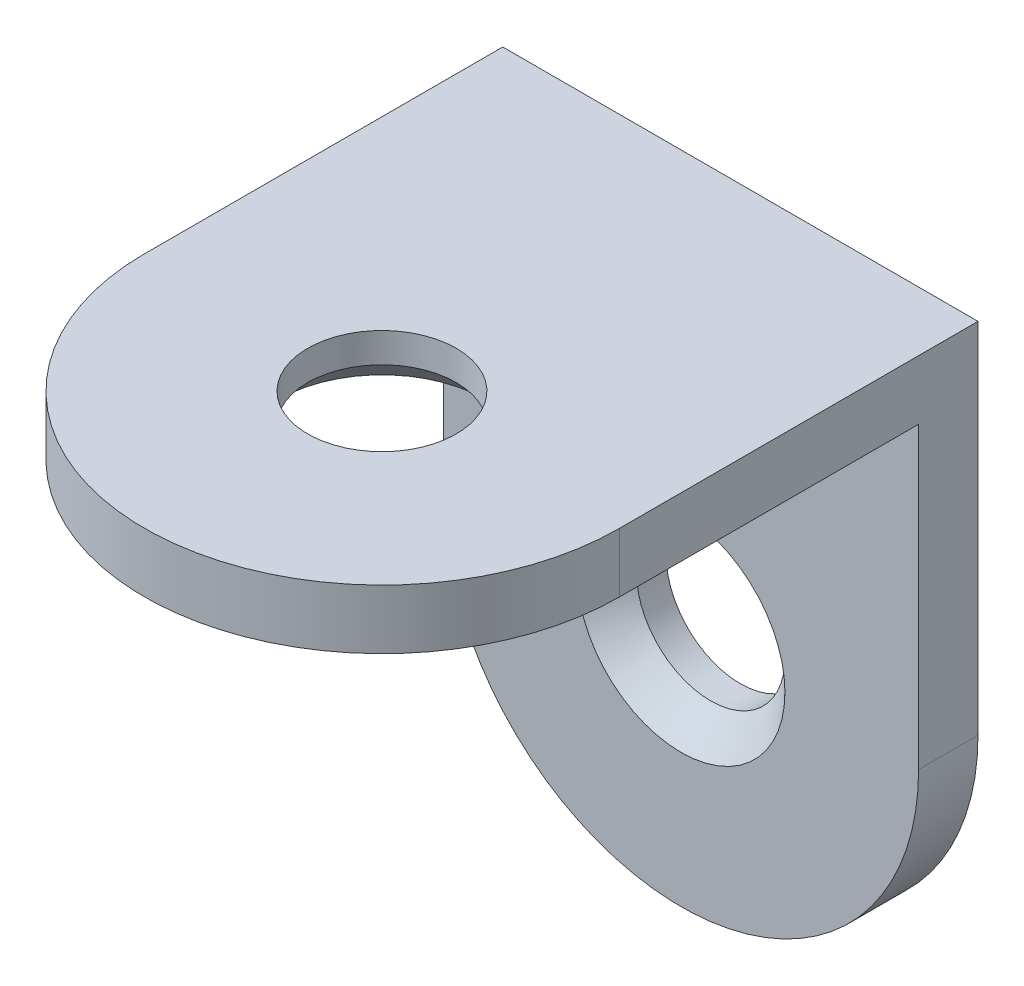
ISO-10303-21;
HEADER;
FILE_DESCRIPTION(('STEP AP214'),'2;1');
FILE_NAME('part.step','',(''),(''),'','','');
FILE_SCHEMA(('AUTOMOTIVE_DESIGN { 1 0 10303 214 1 1 1 1 }'));
ENDSEC;
DATA;
#1=APPLICATION_CONTEXT('core data for automotive mechanical design processes');
#2=APPLICATION_PROTOCOL_DEFINITION('international standard','automotive_design',2000,#1);
#3=PRODUCT_CONTEXT('',#1,'mechanical');
#4=PRODUCT('Part','Part','',(#3));
#5=PRODUCT_RELATED_PRODUCT_CATEGORY('part','',(#4));
#6=PRODUCT_DEFINITION_FORMATION('','',#4);
#7=PRODUCT_DEFINITION_CONTEXT('part definition',#1,'design');
#8=PRODUCT_DEFINITION('design','',#6,#7);
#9=PRODUCT_DEFINITION_SHAPE('','',#8);
#10=(LENGTH_UNIT() NAMED_UNIT(*) SI_UNIT(.MILLI.,.METRE.));
#11=(NAMED_UNIT(*) PLANE_ANGLE_UNIT() SI_UNIT($,.RADIAN.));
#12=(NAMED_UNIT(*) SI_UNIT($,.STERADIAN.) SOLID_ANGLE_UNIT());
#13=UNCERTAINTY_MEASURE_WITH_UNIT(LENGTH_MEASURE(1.E-05),#10,'distance_accuracy_value','');
#14=(GEOMETRIC_REPRESENTATION_CONTEXT(3) GLOBAL_UNCERTAINTY_ASSIGNED_CONTEXT((#13)) GLOBAL_UNIT_ASSIGNED_CONTEXT((#10,
#11,#12)) REPRESENTATION_CONTEXT('',''));
#15=CARTESIAN_POINT('',(0.,0.,0.));
#16=DIRECTION('',(0.,0.,1.));
#17=DIRECTION('',(1.,0.,0.));
#18=AXIS2_PLACEMENT_3D('',#15,#16,#17);
#19=CARTESIAN_POINT('',(-8.001,-20.07,2.));
#20=DIRECTION('',(0.,0.,-1.));
#21=DIRECTION('',(-1.,0.,0.));
#22=AXIS2_PLACEMENT_3D('',#19,#20,#21);
#23=PLANE('',#22);
#24=CARTESIAN_POINT('',(0.,-12.069,2.));
#25=DIRECTION('',(0.,0.,-1.));
#26=DIRECTION('',(-1.,0.,0.));
#27=AXIS2_PLACEMENT_3D('',#24,#25,#26);
#28=CIRCLE('',#27,3.50000000000001);
#29=CARTESIAN_POINT('',(-3.50000000000001,-12.069,2.));
#30=VERTEX_POINT('',#29);
#31=EDGE_CURVE('E137',#30,#30,#28,.T.);
#32=ORIENTED_EDGE('',*,*,#31,.T.);
#33=EDGE_LOOP('',(#32));
#34=FACE_BOUND('',#33,.T.);
#35=DIRECTION('',(0.,1.,0.));
#36=VECTOR('',#35,1.);
#37=CARTESIAN_POINT('',(-8.001,-20.07,2.));
#38=LINE('',#37,#36);
#39=CARTESIAN_POINT('',(-8.001,-12.069,2.));
#40=VERTEX_POINT('',#39);
#41=CARTESIAN_POINT('',(-8.001,-2.,2.));
#42=VERTEX_POINT('',#41);
#43=EDGE_CURVE('E103',#40,#42,#38,.T.);
#44=ORIENTED_EDGE('',*,*,#43,.F.);
#45=CARTESIAN_POINT('',(0.,-12.069,2.));
#46=DIRECTION('',(0.,0.,-1.));
#47=DIRECTION('',(1.,0.,0.));
#48=AXIS2_PLACEMENT_3D('',#45,#46,#47);
#49=CIRCLE('',#48,8.001);
#50=CARTESIAN_POINT('',(8.001,-12.069,2.));
#51=VERTEX_POINT('',#50);
#52=EDGE_CURVE('E89',#51,#40,#49,.T.);
#53=ORIENTED_EDGE('',*,*,#52,.F.);
#54=DIRECTION('',(0.,1.,0.));
#55=VECTOR('',#54,1.);
#56=CARTESIAN_POINT('',(8.001,-20.07,2.));
#57=LINE('',#56,#55);
#58=CARTESIAN_POINT('',(8.001,-2.,2.));
#59=VERTEX_POINT('',#58);
#60=EDGE_CURVE('E273',#51,#59,#57,.T.);
#61=ORIENTED_EDGE('',*,*,#60,.T.);
#62=DIRECTION('',(1.,0.,0.));
#63=VECTOR('',#62,1.);
#64=CARTESIAN_POINT('',(-8.001,-2.,2.));
#65=LINE('',#64,#63);
#66=EDGE_CURVE('E109',#42,#59,#65,.T.);
#67=ORIENTED_EDGE('',*,*,#66,.F.);
#68=EDGE_LOOP('',(#44,#53,#61,#67));
#69=FACE_BOUND('',#68,.T.);
#70=ADVANCED_FACE('F37',(#34,#69),#23,.F.);
#71=CARTESIAN_POINT('',(-8.001,0.,0.));
#72=DIRECTION('',(0.,0.,1.));
#73=DIRECTION('',(0.,-1.,0.));
#74=AXIS2_PLACEMENT_3D('',#71,#72,#73);
#75=PLANE('',#74);
#76=CARTESIAN_POINT('',(0.,-12.069,0.));
#77=DIRECTION('',(0.,0.,1.));
#78=DIRECTION('',(0.,-1.,0.));
#79=AXIS2_PLACEMENT_3D('',#76,#77,#78);
#80=CIRCLE('',#79,2.5);
#81=CARTESIAN_POINT('',(0.,-14.569,0.));
#82=VERTEX_POINT('',#81);
#83=EDGE_CURVE('E97',#82,#82,#80,.T.);
#84=ORIENTED_EDGE('',*,*,#83,.T.);
#85=EDGE_LOOP('',(#84));
#86=FACE_BOUND('',#85,.T.);
#87=DIRECTION('',(0.,-1.,0.));
#88=VECTOR('',#87,1.);
#89=CARTESIAN_POINT('',(8.001,0.,0.));
#90=LINE('',#89,#88);
#91=CARTESIAN_POINT('',(8.001,0.,0.));
#92=VERTEX_POINT('',#91);
#93=CARTESIAN_POINT('',(8.001,-12.069,0.));
#94=VERTEX_POINT('',#93);
#95=EDGE_CURVE('E112',#92,#94,#90,.T.);
#96=ORIENTED_EDGE('',*,*,#95,.T.);
#97=CARTESIAN_POINT('',(0.,-12.069,0.));
#98=DIRECTION('',(0.,0.,1.));
#99=DIRECTION('',(0.,-1.,0.));
#100=AXIS2_PLACEMENT_3D('',#97,#98,#99);
#101=CIRCLE('',#100,8.001);
#102=CARTESIAN_POINT('',(-8.001,-12.069,0.));
#103=VERTEX_POINT('',#102);
#104=EDGE_CURVE('E53',#94,#103,#101,.F.);
#105=ORIENTED_EDGE('',*,*,#104,.T.);
#106=DIRECTION('',(0.,-1.,0.));
#107=VECTOR('',#106,1.);
#108=CARTESIAN_POINT('',(-8.001,0.,0.));
#109=LINE('',#108,#107);
#110=CARTESIAN_POINT('',(-8.001,0.,0.));
#111=VERTEX_POINT('',#110);
#112=EDGE_CURVE('E106',#111,#103,#109,.T.);
#113=ORIENTED_EDGE('',*,*,#112,.F.);
#114=DIRECTION('',(1.,0.,0.));
#115=VECTOR('',#114,1.);
#116=CARTESIAN_POINT('',(-8.001,0.,0.));
#117=LINE('',#116,#115);
#118=EDGE_CURVE('E123',#111,#92,#117,.T.);
#119=ORIENTED_EDGE('',*,*,#118,.T.);
#120=EDGE_LOOP('',(#96,#105,#113,#119));
#121=FACE_BOUND('',#120,.T.);
#122=ADVANCED_FACE('F164',(#86,#121),#75,.F.);
#123=CARTESIAN_POINT('',(-8.001,-2.,2.));
#124=DIRECTION('',(0.,1.,0.));
#125=DIRECTION('',(0.,0.,1.));
#126=AXIS2_PLACEMENT_3D('',#123,#124,#125);
#127=PLANE('',#126);
#128=CARTESIAN_POINT('',(0.,-2.,12.069));
#129=DIRECTION('',(0.,1.,0.));
#130=DIRECTION('',(0.,0.,1.));
#131=AXIS2_PLACEMENT_3D('',#128,#129,#130);
#132=CIRCLE('',#131,3.5);
#133=CARTESIAN_POINT('',(0.,-2.,15.569));
#134=VERTEX_POINT('',#133);
#135=EDGE_CURVE('E12',#134,#134,#132,.T.);
#136=ORIENTED_EDGE('',*,*,#135,.T.);
#137=EDGE_LOOP('',(#136));
#138=FACE_BOUND('',#137,.T.);
#139=CARTESIAN_POINT('',(0.,-2.,12.069));
#140=DIRECTION('',(0.,1.,0.));
#141=DIRECTION('',(0.,0.,-1.));
#142=AXIS2_PLACEMENT_3D('',#139,#140,#141);
#143=CIRCLE('',#142,8.001);
#144=CARTESIAN_POINT('',(-8.001,-2.,12.069));
#145=VERTEX_POINT('',#144);
#146=CARTESIAN_POINT('',(8.001,-2.,12.069));
#147=VERTEX_POINT('',#146);
#148=EDGE_CURVE('E61',#145,#147,#143,.T.);
#149=ORIENTED_EDGE('',*,*,#148,.F.);
#150=DIRECTION('',(0.,0.,1.));
#151=VECTOR('',#150,1.);
#152=CARTESIAN_POINT('',(-8.001,-2.,2.));
#153=LINE('',#152,#151);
#154=EDGE_CURVE('E111',#42,#145,#153,.T.);
#155=ORIENTED_EDGE('',*,*,#154,.F.);
#156=ORIENTED_EDGE('',*,*,#66,.T.);
#157=DIRECTION('',(0.,0.,1.));
#158=VECTOR('',#157,1.);
#159=CARTESIAN_POINT('',(8.001,-2.,2.));
#160=LINE('',#159,#158);
#161=EDGE_CURVE('E275',#59,#147,#160,.T.);
#162=ORIENTED_EDGE('',*,*,#161,.T.);
#163=EDGE_LOOP('',(#149,#155,#156,#162));
#164=FACE_BOUND('',#163,.T.);
#165=ADVANCED_FACE('F170',(#138,#164),#127,.F.);
#166=CARTESIAN_POINT('',(-8.001,0.,20.07));
#167=DIRECTION('',(0.,-1.,0.));
#168=DIRECTION('',(0.,0.,-1.));
#169=AXIS2_PLACEMENT_3D('',#166,#167,#168);
#170=PLANE('',#169);
#171=CARTESIAN_POINT('',(0.,0.,12.069));
#172=DIRECTION('',(0.,-1.,0.));
#173=DIRECTION('',(0.,0.,-1.));
#174=AXIS2_PLACEMENT_3D('',#171,#172,#173);
#175=CIRCLE('',#174,2.5);
#176=CARTESIAN_POINT('',(0.,0.,9.569));
#177=VERTEX_POINT('',#176);
#178=EDGE_CURVE('E133',#177,#177,#175,.T.);
#179=ORIENTED_EDGE('',*,*,#178,.T.);
#180=EDGE_LOOP('',(#179));
#181=FACE_BOUND('',#180,.T.);
#182=DIRECTION('',(0.,0.,-1.));
#183=VECTOR('',#182,1.);
#184=CARTESIAN_POINT('',(-8.001,0.,20.07));
#185=LINE('',#184,#183);
#186=CARTESIAN_POINT('',(-8.001,0.,12.069));
#187=VERTEX_POINT('',#186);
#188=EDGE_CURVE('E114',#187,#111,#185,.T.);
#189=ORIENTED_EDGE('',*,*,#188,.F.);
#190=CARTESIAN_POINT('',(0.,0.,12.069));
#191=DIRECTION('',(0.,-1.,0.));
#192=DIRECTION('',(0.,0.,-1.));
#193=AXIS2_PLACEMENT_3D('',#190,#191,#192);
#194=CIRCLE('',#193,8.001);
#195=CARTESIAN_POINT('',(8.001,0.,12.069));
#196=VERTEX_POINT('',#195);
#197=EDGE_CURVE('E276',#187,#196,#194,.F.);
#198=ORIENTED_EDGE('',*,*,#197,.T.);
#199=DIRECTION('',(0.,0.,-1.));
#200=VECTOR('',#199,1.);
#201=CARTESIAN_POINT('',(8.001,0.,20.07));
#202=LINE('',#201,#200);
#203=EDGE_CURVE('E117',#196,#92,#202,.T.);
#204=ORIENTED_EDGE('',*,*,#203,.T.);
#205=ORIENTED_EDGE('',*,*,#118,.F.);
#206=EDGE_LOOP('',(#189,#198,#204,#205));
#207=FACE_BOUND('',#206,.T.);
#208=ADVANCED_FACE('F176',(#181,#207),#170,.F.);
#209=CARTESIAN_POINT('',(-8.001,0.,0.));
#210=DIRECTION('',(-1.,0.,0.));
#211=DIRECTION('',(0.,0.,1.));
#212=AXIS2_PLACEMENT_3D('',#209,#210,#211);
#213=PLANE('',#212);
#214=DIRECTION('',(0.,0.,1.));
#215=VECTOR('',#214,1.);
#216=CARTESIAN_POINT('',(-8.001,-12.069,-6.001));
#217=LINE('',#216,#215);
#218=EDGE_CURVE('E92',#103,#40,#217,.T.);
#219=ORIENTED_EDGE('',*,*,#218,.T.);
#220=ORIENTED_EDGE('',*,*,#43,.T.);
#221=ORIENTED_EDGE('',*,*,#154,.T.);
#222=DIRECTION('',(0.,-1.,0.));
#223=VECTOR('',#222,1.);
#224=CARTESIAN_POINT('',(-8.001,6.001,12.069));
#225=LINE('',#224,#223);
#226=EDGE_CURVE('E280',#187,#145,#225,.T.);
#227=ORIENTED_EDGE('',*,*,#226,.F.);
#228=ORIENTED_EDGE('',*,*,#188,.T.);
#229=ORIENTED_EDGE('',*,*,#112,.T.);
#230=EDGE_LOOP('',(#219,#220,#221,#227,#228,#229));
#231=FACE_BOUND('',#230,.T.);
#232=ADVANCED_FACE('F101',(#231),#213,.T.);
#233=CARTESIAN_POINT('',(8.001,0.,0.));
#234=DIRECTION('',(-1.,0.,0.));
#235=DIRECTION('',(0.,0.,1.));
#236=AXIS2_PLACEMENT_3D('',#233,#234,#235);
#237=PLANE('',#236);
#238=ORIENTED_EDGE('',*,*,#60,.F.);
#239=DIRECTION('',(0.,0.,-1.));
#240=VECTOR('',#239,1.);
#241=CARTESIAN_POINT('',(8.001,-12.069,0.));
#242=LINE('',#241,#240);
#243=EDGE_CURVE('E93',#51,#94,#242,.T.);
#244=ORIENTED_EDGE('',*,*,#243,.T.);
#245=ORIENTED_EDGE('',*,*,#95,.F.);
#246=ORIENTED_EDGE('',*,*,#203,.F.);
#247=DIRECTION('',(0.,-1.,0.));
#248=VECTOR('',#247,1.);
#249=CARTESIAN_POINT('',(8.001,0.,12.069));
#250=LINE('',#249,#248);
#251=EDGE_CURVE('E127',#196,#147,#250,.T.);
#252=ORIENTED_EDGE('',*,*,#251,.T.);
#253=ORIENTED_EDGE('',*,*,#161,.F.);
#254=EDGE_LOOP('',(#238,#244,#245,#246,#252,#253));
#255=FACE_BOUND('',#254,.T.);
#256=ADVANCED_FACE('F183',(#255),#237,.F.);
#257=CARTESIAN_POINT('',(0.,6.001,12.069));
#258=DIRECTION('',(0.,-1.,0.));
#259=DIRECTION('',(0.,0.,-1.));
#260=AXIS2_PLACEMENT_3D('',#257,#258,#259);
#261=CYLINDRICAL_SURFACE('',#260,8.001);
#262=ORIENTED_EDGE('',*,*,#148,.T.);
#263=ORIENTED_EDGE('',*,*,#251,.F.);
#264=ORIENTED_EDGE('',*,*,#197,.F.);
#265=ORIENTED_EDGE('',*,*,#226,.T.);
#266=EDGE_LOOP('',(#262,#263,#264,#265));
#267=FACE_BOUND('',#266,.T.);
#268=ADVANCED_FACE('F186',(#267),#261,.T.);
#269=CARTESIAN_POINT('',(0.,-12.069,-6.001));
#270=DIRECTION('',(0.,0.,1.));
#271=DIRECTION('',(1.,0.,0.));
#272=AXIS2_PLACEMENT_3D('',#269,#270,#271);
#273=CYLINDRICAL_SURFACE('',#272,8.001);
#274=ORIENTED_EDGE('',*,*,#52,.T.);
#275=ORIENTED_EDGE('',*,*,#218,.F.);
#276=ORIENTED_EDGE('',*,*,#104,.F.);
#277=ORIENTED_EDGE('',*,*,#243,.F.);
#278=EDGE_LOOP('',(#274,#275,#276,#277));
#279=FACE_BOUND('',#278,.T.);
#280=ADVANCED_FACE('F91',(#279),#273,.T.);
#281=CARTESIAN_POINT('',(0.,-12.069,-8.));
#282=DIRECTION('',(0.,0.,1.));
#283=DIRECTION('',(1.,0.,0.));
#284=AXIS2_PLACEMENT_3D('',#281,#282,#283);
#285=CYLINDRICAL_SURFACE('',#284,2.5);
#286=CARTESIAN_POINT('',(0.,-12.069,0.999999999999994));
#287=DIRECTION('',(0.,0.,-1.));
#288=DIRECTION('',(-1.,0.,0.));
#289=AXIS2_PLACEMENT_3D('',#286,#287,#288);
#290=CIRCLE('',#289,2.5);
#291=CARTESIAN_POINT('',(-2.5,-12.069,0.999999999999994));
#292=VERTEX_POINT('',#291);
#293=EDGE_CURVE('E130',#292,#292,#290,.F.);
#294=ORIENTED_EDGE('',*,*,#293,.T.);
#295=EDGE_LOOP('',(#294));
#296=FACE_BOUND('',#295,.T.);
#297=ORIENTED_EDGE('',*,*,#83,.F.);
#298=EDGE_LOOP('',(#297));
#299=FACE_BOUND('',#298,.T.);
#300=ADVANCED_FACE('F192',(#296,#299),#285,.F.);
#301=CARTESIAN_POINT('',(0.,8.,12.069));
#302=DIRECTION('',(0.,-1.,0.));
#303=DIRECTION('',(0.,0.,-1.));
#304=AXIS2_PLACEMENT_3D('',#301,#302,#303);
#305=CYLINDRICAL_SURFACE('',#304,2.5);
#306=CARTESIAN_POINT('',(0.,-1.00000000000001,12.069));
#307=DIRECTION('',(0.,1.,0.));
#308=DIRECTION('',(0.,0.,1.));
#309=AXIS2_PLACEMENT_3D('',#306,#307,#308);
#310=CIRCLE('',#309,2.5);
#311=CARTESIAN_POINT('',(0.,-1.00000000000001,14.569));
#312=VERTEX_POINT('',#311);
#313=EDGE_CURVE('E46',#312,#312,#310,.F.);
#314=ORIENTED_EDGE('',*,*,#313,.T.);
#315=EDGE_LOOP('',(#314));
#316=FACE_BOUND('',#315,.T.);
#317=ORIENTED_EDGE('',*,*,#178,.F.);
#318=EDGE_LOOP('',(#317));
#319=FACE_BOUND('',#318,.T.);
#320=ADVANCED_FACE('F152',(#316,#319),#305,.F.);
#321=CARTESIAN_POINT('',(0.,-12.069,0.999999999999994));
#322=DIRECTION('',(0.,0.,1.));
#323=DIRECTION('',(1.,0.,0.));
#324=AXIS2_PLACEMENT_3D('',#321,#322,#323);
#325=CONICAL_SURFACE('',#324,2.5,0.78539816339745);
#326=ORIENTED_EDGE('',*,*,#31,.F.);
#327=EDGE_LOOP('',(#326));
#328=FACE_BOUND('',#327,.T.);
#329=ORIENTED_EDGE('',*,*,#293,.F.);
#330=EDGE_LOOP('',(#329));
#331=FACE_BOUND('',#330,.T.);
#332=ADVANCED_FACE('F156',(#328,#331),#325,.F.);
#333=CARTESIAN_POINT('',(0.,-1.00000000000001,12.069));
#334=DIRECTION('',(0.,-1.,0.));
#335=DIRECTION('',(0.,0.,-1.));
#336=AXIS2_PLACEMENT_3D('',#333,#334,#335);
#337=CONICAL_SURFACE('',#336,2.5,0.785398163397451);
#338=ORIENTED_EDGE('',*,*,#135,.F.);
#339=EDGE_LOOP('',(#338));
#340=FACE_BOUND('',#339,.T.);
#341=ORIENTED_EDGE('',*,*,#313,.F.);
#342=EDGE_LOOP('',(#341));
#343=FACE_BOUND('',#342,.T.);
#344=ADVANCED_FACE('F39',(#340,#343),#337,.F.);
#345=CLOSED_SHELL('',(#70,#122,#165,#208,#232,#256,#268,#280,#300,#320,#332,#344));
#346=MANIFOLD_SOLID_BREP('B2',#345);
#347=ADVANCED_BREP_SHAPE_REPRESENTATION('',(#18,#346),#14);
#348=SHAPE_DEFINITION_REPRESENTATION(#9,#347);
ENDSEC;
END-ISO-10303-21;
